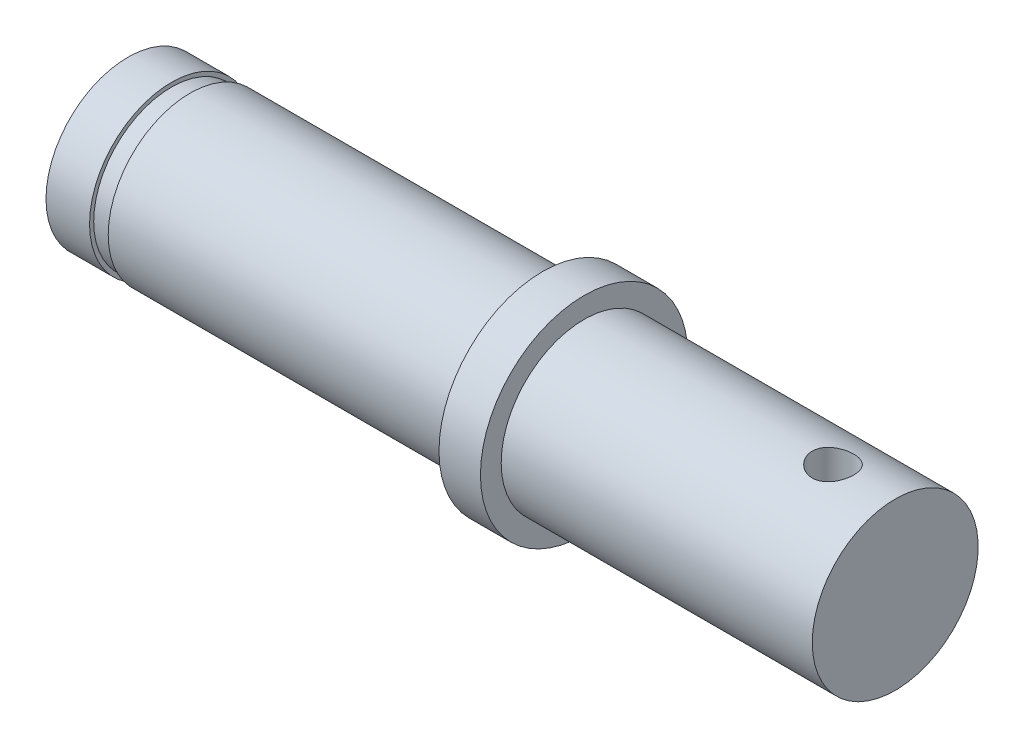
ISO-10303-21;
HEADER;
FILE_DESCRIPTION(('STEP AP214'),'2;1');
FILE_NAME('part.step','',(''),(''),'','','');
FILE_SCHEMA(('AUTOMOTIVE_DESIGN { 1 0 10303 214 1 1 1 1 }'));
ENDSEC;
DATA;
#1=APPLICATION_CONTEXT('core data for automotive mechanical design processes');
#2=APPLICATION_PROTOCOL_DEFINITION('international standard','automotive_design',2000,#1);
#3=PRODUCT_CONTEXT('',#1,'mechanical');
#4=PRODUCT('Part','Part','',(#3));
#5=PRODUCT_RELATED_PRODUCT_CATEGORY('part','',(#4));
#6=PRODUCT_DEFINITION_FORMATION('','',#4);
#7=PRODUCT_DEFINITION_CONTEXT('part definition',#1,'design');
#8=PRODUCT_DEFINITION('design','',#6,#7);
#9=PRODUCT_DEFINITION_SHAPE('','',#8);
#10=(LENGTH_UNIT() NAMED_UNIT(*) SI_UNIT(.MILLI.,.METRE.));
#11=(NAMED_UNIT(*) PLANE_ANGLE_UNIT() SI_UNIT($,.RADIAN.));
#12=(NAMED_UNIT(*) SI_UNIT($,.STERADIAN.) SOLID_ANGLE_UNIT());
#13=UNCERTAINTY_MEASURE_WITH_UNIT(LENGTH_MEASURE(1.E-05),#10,'distance_accuracy_value','');
#14=(GEOMETRIC_REPRESENTATION_CONTEXT(3) GLOBAL_UNCERTAINTY_ASSIGNED_CONTEXT((#13)) GLOBAL_UNIT_ASSIGNED_CONTEXT((#10,
#11,#12)) REPRESENTATION_CONTEXT('',''));
#15=CARTESIAN_POINT('',(0.,0.,0.));
#16=DIRECTION('',(0.,0.,1.));
#17=DIRECTION('',(1.,0.,0.));
#18=AXIS2_PLACEMENT_3D('',#15,#16,#17);
#19=CARTESIAN_POINT('',(-15.4994299751339,3.95,0.));
#20=DIRECTION('',(1.,0.,0.));
#21=DIRECTION('',(0.,0.,-1.));
#22=AXIS2_PLACEMENT_3D('',#19,#20,#21);
#23=PLANE('',#22);
#24=CARTESIAN_POINT('',(-15.4994299751339,0.,0.));
#25=DIRECTION('',(-1.,0.,0.));
#26=DIRECTION('',(0.,0.,1.));
#27=AXIS2_PLACEMENT_3D('',#24,#25,#26);
#28=CIRCLE('',#27,3.95);
#29=CARTESIAN_POINT('',(-15.4994299751339,0.,3.95));
#30=VERTEX_POINT('',#29);
#31=EDGE_CURVE('E122',#30,#30,#28,.T.);
#32=ORIENTED_EDGE('',*,*,#31,.T.);
#33=EDGE_LOOP('',(#32));
#34=FACE_BOUND('',#33,.T.);
#35=ADVANCED_FACE('F45',(#34),#23,.F.);
#36=CARTESIAN_POINT('',(21.5005700248661,0.,0.));
#37=DIRECTION('',(-1.,0.,0.));
#38=DIRECTION('',(0.,0.,1.));
#39=AXIS2_PLACEMENT_3D('',#36,#37,#38);
#40=PLANE('',#39);
#41=CARTESIAN_POINT('',(21.5005700248661,0.,0.));
#42=DIRECTION('',(-1.,0.,0.));
#43=DIRECTION('',(0.,0.,1.));
#44=AXIS2_PLACEMENT_3D('',#41,#42,#43);
#45=CIRCLE('',#44,4.);
#46=CARTESIAN_POINT('',(21.5005700248661,0.,4.));
#47=VERTEX_POINT('',#46);
#48=EDGE_CURVE('E12',#47,#47,#45,.T.);
#49=ORIENTED_EDGE('',*,*,#48,.F.);
#50=EDGE_LOOP('',(#49));
#51=FACE_BOUND('',#50,.T.);
#52=ADVANCED_FACE('F110',(#51),#40,.F.);
#53=CARTESIAN_POINT('',(-15.4994299751339,0.,0.));
#54=DIRECTION('',(-1.,0.,0.));
#55=DIRECTION('',(0.,0.,1.));
#56=AXIS2_PLACEMENT_3D('',#53,#54,#55);
#57=CYLINDRICAL_SURFACE('',#56,4.);
#58=CARTESIAN_POINT('',(18.5005700248661,-3.87298334620742,1.));
#59=CARTESIAN_POINT('',(18.5557903252229,-3.87298440057185,0.9999984314387));
#60=CARTESIAN_POINT('',(18.6110279842975,-3.87417722499279,0.995410498208071));
#61=CARTESIAN_POINT('',(18.7199170560987,-3.87880744892249,0.977209250194448));
#62=CARTESIAN_POINT('',(18.7735675266461,-3.88224615474181,0.963590682698079));
#63=CARTESIAN_POINT('',(18.8776914401539,-3.89095489813012,0.927796479849636));
#64=CARTESIAN_POINT('',(18.9281688870239,-3.8962225706936,0.905631891140945));
#65=CARTESIAN_POINT('',(19.0246943658786,-3.90799276818328,0.853408456505409));
#66=CARTESIAN_POINT('',(19.0707422096973,-3.91449534553241,0.823349275424507));
#67=CARTESIAN_POINT('',(19.158114682972,-3.92816286540369,0.755483370924519));
#68=CARTESIAN_POINT('',(19.1993274650064,-3.93533839048709,0.717534755081559));
#69=CARTESIAN_POINT('',(19.27487458261,-3.94945150206622,0.635272825640329));
#70=CARTESIAN_POINT('',(19.3092082751147,-3.95638906626692,0.590958917672141));
#71=CARTESIAN_POINT('',(19.3704802119187,-3.96936166208095,0.496458080431566));
#72=CARTESIAN_POINT('',(19.3973085801307,-3.975382749602,0.446197830478045));
#73=CARTESIAN_POINT('',(19.4420938825273,-3.98572324770431,0.34170527371711));
#74=CARTESIAN_POINT('',(19.4600521256323,-3.99004290933748,0.287473554316778));
#75=CARTESIAN_POINT('',(19.4862291586975,-3.99641903539263,0.177743503501663));
#76=CARTESIAN_POINT('',(19.4946378825967,-3.99851957537724,0.12229308781959));
#77=CARTESIAN_POINT('',(19.5020733765763,-4.00037437642922,0.0107315277051081));
#78=CARTESIAN_POINT('',(19.5011015337499,-4.00012898438683,-0.0453795178152274));
#79=CARTESIAN_POINT('',(19.4899400847661,-3.99735237981414,-0.155352247172388));
#80=CARTESIAN_POINT('',(19.4799554948446,-3.9948720093635,-0.209236215601067));
#81=CARTESIAN_POINT('',(19.4513815168467,-3.98796334609942,-0.314538247413687));
#82=CARTESIAN_POINT('',(19.4327916707151,-3.98353494959377,-0.365956179370439));
#83=CARTESIAN_POINT('',(19.3873689965913,-3.97315003880359,-0.465406703501807));
#84=CARTESIAN_POINT('',(19.3604632070014,-3.96718007878022,-0.513404509766505));
#85=CARTESIAN_POINT('',(19.2992277532196,-3.9543596152386,-0.604275622340489));
#86=CARTESIAN_POINT('',(19.2648967974419,-3.94750895860996,-0.647148035085506));
#87=CARTESIAN_POINT('',(19.1886865280732,-3.93345485507809,-0.727774035084958));
#88=CARTESIAN_POINT('',(19.146628067927,-3.92624687810367,-0.765357679075201));
#89=CARTESIAN_POINT('',(19.05673003545,-3.91246017406683,-0.83297637596302));
#90=CARTESIAN_POINT('',(19.0088901930697,-3.90588147642389,-0.863011076046018));
#91=CARTESIAN_POINT('',(18.9084540112065,-3.8940819873266,-0.914788129022599));
#92=CARTESIAN_POINT('',(18.8558357327408,-3.88886793490289,-0.936489566970492));
#93=CARTESIAN_POINT('',(18.7475358376355,-3.88047456055983,-0.970685620636342));
#94=CARTESIAN_POINT('',(18.6918548792729,-3.87729480324088,-0.983182206552911));
#95=CARTESIAN_POINT('',(18.5805862242569,-3.87342142415657,-0.998331855466072));
#96=CARTESIAN_POINT('',(18.5250349075343,-3.8726643563746,-1.00123618956785));
#97=CARTESIAN_POINT('',(18.4142412502348,-3.87354937392416,-0.99780679620622));
#98=CARTESIAN_POINT('',(18.3589988816856,-3.87519123840507,-0.991473919139521));
#99=CARTESIAN_POINT('',(18.2513243188842,-3.88062832781825,-0.969970185575066));
#100=CARTESIAN_POINT('',(18.1988609342378,-3.8843878809375,-0.954945627312699));
#101=CARTESIAN_POINT('',(18.0971974417254,-3.89360287308385,-0.916647232668249));
#102=CARTESIAN_POINT('',(18.047997721244,-3.89905851299446,-0.89337241908502));
#103=CARTESIAN_POINT('',(17.9531935137192,-3.91118454837305,-0.838708267174625));
#104=CARTESIAN_POINT('',(17.9076784888489,-3.91787667442657,-0.807168701534253));
#105=CARTESIAN_POINT('',(17.8224946797456,-3.93166833228687,-0.737060292934457));
#106=CARTESIAN_POINT('',(17.7828268582061,-3.93876793091388,-0.698490294805441));
#107=CARTESIAN_POINT('',(17.7094456078377,-3.95278961212643,-0.614262720984727));
#108=CARTESIAN_POINT('',(17.6759059998466,-3.95970280824735,-0.568451952531595));
#109=CARTESIAN_POINT('',(17.6169956780856,-3.97238886645494,-0.471702682694678));
#110=CARTESIAN_POINT('',(17.5916245382228,-3.97816178801584,-0.420764448957593));
#111=CARTESIAN_POINT('',(17.5499916110549,-3.98788046295326,-0.315558201731091));
#112=CARTESIAN_POINT('',(17.5336643111145,-3.99183932008964,-0.261317381027882));
#113=CARTESIAN_POINT('',(17.5103858910227,-3.99754117358316,-0.150749760318808));
#114=CARTESIAN_POINT('',(17.5034329613705,-3.99928459757364,-0.094423365041244));
#115=CARTESIAN_POINT('',(17.4992024352906,-4.00034169408812,0.0170835264433262));
#116=CARTESIAN_POINT('',(17.5016683157707,-3.99971978880009,0.0722538269660331));
#117=CARTESIAN_POINT('',(17.5156178521604,-3.99625896457424,0.18136749641474));
#118=CARTESIAN_POINT('',(17.5271012398792,-3.99342011157095,0.235310901780887));
#119=CARTESIAN_POINT('',(17.558622244637,-3.98585432853964,0.340171035644816));
#120=CARTESIAN_POINT('',(17.5786134781807,-3.98113764502669,0.391102494581018));
#121=CARTESIAN_POINT('',(17.6265406038854,-3.97031288913382,0.488917053041467));
#122=CARTESIAN_POINT('',(17.6544774975357,-3.96420464137727,0.535799641265051));
#123=CARTESIAN_POINT('',(17.7182852588632,-3.95107249681343,0.625401928423901));
#124=CARTESIAN_POINT('',(17.7543301677735,-3.94403016945647,0.667994988300587));
#125=CARTESIAN_POINT('',(17.8329928768399,-3.92990649053207,0.746615020271252));
#126=CARTESIAN_POINT('',(17.8756123409641,-3.92282512952424,0.782640325068178));
#127=CARTESIAN_POINT('',(17.9671714390674,-3.90927475860683,0.847762026479241));
#128=CARTESIAN_POINT('',(18.0162141482786,-3.90281963730391,0.876716619446595));
#129=CARTESIAN_POINT('',(18.118625514789,-3.8914395555011,0.925926896615624));
#130=CARTESIAN_POINT('',(18.1719909909734,-3.88651348244815,0.946188909759558));
#131=CARTESIAN_POINT('',(18.2711470366924,-3.87951908741315,0.974422528565573));
#132=CARTESIAN_POINT('',(18.3164631892485,-3.87708663005762,0.98399317059583));
#133=CARTESIAN_POINT('',(18.4080388938676,-3.87381838580358,0.996782292572821));
#134=CARTESIAN_POINT('',(18.4542983651167,-3.87298246270639,1.00000131437052));
#135=CARTESIAN_POINT('',(18.5005700248661,-3.87298334620742,1.));
#136=B_SPLINE_CURVE_WITH_KNOTS('',3,(#58,#59,#60,#61,#62,#63,#64,#65,#66,#67,#68,#69,#70,#71,
#72,#73,#74,#75,#76,#77,#78,#79,#80,#81,#82,#83,#84,#85,#86,#87,#88,#89,#90,#91,#92,#93,#94,#95,
#96,#97,#98,#99,#100,#101,#102,#103,#104,#105,#106,#107,#108,#109,#110,#111,#112,#113,#114,#115,
#116,#117,#118,#119,#120,#121,#122,#123,#124,#125,#126,#127,#128,#129,#130,#131,#132,#133,#134,
#135),.UNSPECIFIED.,.T.,.F.,(4,2,2,2,2,2,2,2,2,2,2,2,2,2,2,2,2,2,2,2,2,2,2,2,2,2,2,2,2,2,2,2,2,
2,2,2,2,2,4),(0.,0.16549097667523,0.331078296534212,0.496452290829149,0.66183330698466,
0.83049581673465,0.999174085882213,1.17020598555443,1.34121263935112,1.50875500394413,
1.67627259462683,1.84007305071854,2.00388222686189,2.16917149698053,2.3344895418384,
2.5042818662504,2.67408212476196,2.84470572799636,3.01529280048094,3.18137429900962,
3.34744050869796,3.51078961999958,3.67415808564842,3.84073138339938,4.00733207550293,
4.17810132382402,4.34886166284096,4.51836829119047,4.6878421955989,4.85273378447258,
5.01762046947068,5.18161950620159,5.34563922291504,5.51358838629103,5.68158012622479,
5.85270590910146,6.02370688542923,6.16239130867207,6.30106390036084),.UNSPECIFIED.);
#137=CARTESIAN_POINT('',(18.5005700248661,-3.87298334620742,1.));
#138=VERTEX_POINT('',#137);
#139=EDGE_CURVE('E48',#138,#138,#136,.T.);
#140=ORIENTED_EDGE('',*,*,#139,.T.);
#141=EDGE_LOOP('',(#140));
#142=FACE_BOUND('',#141,.T.);
#143=CARTESIAN_POINT('',(18.5005700248661,3.87298334620742,1.));
#144=CARTESIAN_POINT('',(18.4453497245093,3.87298440057185,0.9999984314387));
#145=CARTESIAN_POINT('',(18.3901120654348,3.87417722499279,0.995410498208071));
#146=CARTESIAN_POINT('',(18.2812229936335,3.87880744892249,0.977209250194448));
#147=CARTESIAN_POINT('',(18.2275725230861,3.88224615474181,0.963590682698079));
#148=CARTESIAN_POINT('',(18.1234486095783,3.89095489813012,0.927796479849635));
#149=CARTESIAN_POINT('',(18.0729711627083,3.8962225706936,0.905631891140943));
#150=CARTESIAN_POINT('',(17.9764456838536,3.90799276818328,0.853408456505406));
#151=CARTESIAN_POINT('',(17.930397840035,3.91449534553241,0.823349275424506));
#152=CARTESIAN_POINT('',(17.8430253667603,3.92816286540369,0.755483370924519));
#153=CARTESIAN_POINT('',(17.8018125847258,3.93533839048709,0.717534755081559));
#154=CARTESIAN_POINT('',(17.7262654671222,3.94945150206622,0.635272825640329));
#155=CARTESIAN_POINT('',(17.6919317746175,3.95638906626692,0.590958917672141));
#156=CARTESIAN_POINT('',(17.6306598378135,3.96936166208095,0.496458080431566));
#157=CARTESIAN_POINT('',(17.6038314696015,3.975382749602,0.446197830478045));
#158=CARTESIAN_POINT('',(17.5590461672049,3.98572324770431,0.34170527371711));
#159=CARTESIAN_POINT('',(17.5410879240999,3.99004290933748,0.287473554316778));
#160=CARTESIAN_POINT('',(17.5149108910347,3.99641903539263,0.177743503501663));
#161=CARTESIAN_POINT('',(17.5065021671355,3.99851957537724,0.12229308781959));
#162=CARTESIAN_POINT('',(17.4990666731559,4.00037437642922,0.0107315277051081));
#163=CARTESIAN_POINT('',(17.5000385159823,4.00012898438683,-0.0453795178152275));
#164=CARTESIAN_POINT('',(17.5111999649662,3.99735237981414,-0.155352247172388));
#165=CARTESIAN_POINT('',(17.5211845548877,3.9948720093635,-0.209236215601067));
#166=CARTESIAN_POINT('',(17.5497585328855,3.98796334609942,-0.314538247413687));
#167=CARTESIAN_POINT('',(17.5683483790171,3.98353494959377,-0.365956179370439));
#168=CARTESIAN_POINT('',(17.6137710531409,3.97315003880359,-0.465406703501808));
#169=CARTESIAN_POINT('',(17.6406768427308,3.96718007878022,-0.513404509766506));
#170=CARTESIAN_POINT('',(17.7019122965126,3.9543596152386,-0.60427562234049));
#171=CARTESIAN_POINT('',(17.7362432522904,3.94750895860996,-0.647148035085507));
#172=CARTESIAN_POINT('',(17.8124535216591,3.93345485507809,-0.727774035084958));
#173=CARTESIAN_POINT('',(17.8545119818052,3.92624687810367,-0.765357679075201));
#174=CARTESIAN_POINT('',(17.9444100142822,3.91246017406683,-0.83297637596302));
#175=CARTESIAN_POINT('',(17.9922498566625,3.90588147642389,-0.863011076046018));
#176=CARTESIAN_POINT('',(18.0926860385257,3.8940819873266,-0.914788129022599));
#177=CARTESIAN_POINT('',(18.1453043169914,3.88886793490289,-0.936489566970492));
#178=CARTESIAN_POINT('',(18.2536042120967,3.88047456055983,-0.970685620636342));
#179=CARTESIAN_POINT('',(18.3092851704594,3.87729480324088,-0.983182206552911));
#180=CARTESIAN_POINT('',(18.4205538254754,3.87342142415657,-0.998331855466072));
#181=CARTESIAN_POINT('',(18.476105142198,3.8726643563746,-1.00123618956785));
#182=CARTESIAN_POINT('',(18.5868987994974,3.87354937392416,-0.99780679620622));
#183=CARTESIAN_POINT('',(18.6421411680466,3.87519123840507,-0.991473919139521));
#184=CARTESIAN_POINT('',(18.749815730848,3.88062832781825,-0.969970185575066));
#185=CARTESIAN_POINT('',(18.8022791154944,3.8843878809375,-0.954945627312699));
#186=CARTESIAN_POINT('',(18.9039426080068,3.89360287308385,-0.916647232668249));
#187=CARTESIAN_POINT('',(18.9531423284882,3.89905851299446,-0.89337241908502));
#188=CARTESIAN_POINT('',(19.0479465360131,3.91118454837305,-0.838708267174625));
#189=CARTESIAN_POINT('',(19.0934615608833,3.91787667442657,-0.807168701534253));
#190=CARTESIAN_POINT('',(19.1786453699867,3.93166833228687,-0.737060292934457));
#191=CARTESIAN_POINT('',(19.2183131915261,3.93876793091388,-0.69849029480544));
#192=CARTESIAN_POINT('',(19.2916944418945,3.95278961212643,-0.614262720984726));
#193=CARTESIAN_POINT('',(19.3252340498856,3.95970280824735,-0.568451952531593));
#194=CARTESIAN_POINT('',(19.3841443716466,3.97238886645494,-0.471702682694676));
#195=CARTESIAN_POINT('',(19.4095155115094,3.97816178801584,-0.420764448957591));
#196=CARTESIAN_POINT('',(19.4511484386773,3.98788046295326,-0.315558201731091));
#197=CARTESIAN_POINT('',(19.4674757386177,3.99183932008964,-0.261317381027882));
#198=CARTESIAN_POINT('',(19.4907541587095,3.99754117358316,-0.150749760318809));
#199=CARTESIAN_POINT('',(19.4977070883617,3.99928459757364,-0.0944233650412441));
#200=CARTESIAN_POINT('',(19.5019376144416,4.00034169408812,0.0170835264433262));
#201=CARTESIAN_POINT('',(19.4994717339615,3.99971978880009,0.0722538269660331));
#202=CARTESIAN_POINT('',(19.4855221975718,3.99625896457424,0.18136749641474));
#203=CARTESIAN_POINT('',(19.474038809853,3.99342011157095,0.235310901780887));
#204=CARTESIAN_POINT('',(19.4425178050952,3.98585432853964,0.340171035644816));
#205=CARTESIAN_POINT('',(19.4225265715515,3.98113764502669,0.391102494581018));
#206=CARTESIAN_POINT('',(19.3745994458468,3.97031288913382,0.488917053041467));
#207=CARTESIAN_POINT('',(19.3466625521965,3.96420464137727,0.535799641265051));
#208=CARTESIAN_POINT('',(19.282854790869,3.95107249681343,0.625401928423901));
#209=CARTESIAN_POINT('',(19.2468098819587,3.94403016945647,0.667994988300587));
#210=CARTESIAN_POINT('',(19.1681471728923,3.92990649053207,0.746615020271252));
#211=CARTESIAN_POINT('',(19.1255277087682,3.92282512952424,0.782640325068178));
#212=CARTESIAN_POINT('',(19.0339686106648,3.90927475860683,0.847762026479241));
#213=CARTESIAN_POINT('',(18.9849259014536,3.90281963730391,0.876716619446595));
#214=CARTESIAN_POINT('',(18.8825145349433,3.8914395555011,0.925926896615624));
#215=CARTESIAN_POINT('',(18.8291490587588,3.88651348244815,0.946188909759558));
#216=CARTESIAN_POINT('',(18.7299930130398,3.87951908741315,0.974422528565573));
#217=CARTESIAN_POINT('',(18.6846768604838,3.87708663005762,0.98399317059583));
#218=CARTESIAN_POINT('',(18.5931011558646,3.87381838580358,0.996782292572821));
#219=CARTESIAN_POINT('',(18.5468416846155,3.87298246270639,1.00000131437052));
#220=CARTESIAN_POINT('',(18.5005700248661,3.87298334620742,1.));
#221=B_SPLINE_CURVE_WITH_KNOTS('',3,(#143,#144,#145,#146,#147,#148,#149,#150,#151,#152,#153,
#154,#155,#156,#157,#158,#159,#160,#161,#162,#163,#164,#165,#166,#167,#168,#169,#170,#171,#172,
#173,#174,#175,#176,#177,#178,#179,#180,#181,#182,#183,#184,#185,#186,#187,#188,#189,#190,#191,
#192,#193,#194,#195,#196,#197,#198,#199,#200,#201,#202,#203,#204,#205,#206,#207,#208,#209,#210,
#211,#212,#213,#214,#215,#216,#217,#218,#219,#220),.UNSPECIFIED.,.T.,.F.,(4,2,2,2,2,2,2,2,2,2,2,
2,2,2,2,2,2,2,2,2,2,2,2,2,2,2,2,2,2,2,2,2,2,2,2,2,2,2,4),(0.,0.16549097667523,0.331078296534212,
0.496452290829157,0.66183330698466,0.83049581673465,0.999174085882213,1.17020598555443,
1.34121263935112,1.50875500394413,1.67627259462683,1.84007305071854,2.00388222686189,
2.16917149698053,2.3344895418384,2.5042818662504,2.67408212476196,2.84470572799636,
3.01529280048094,3.18137429900962,3.34744050869796,3.51078961999958,3.67415808564842,
3.84073138339938,4.00733207550293,4.17810132382403,4.34886166284096,4.51836829119047,
4.6878421955989,4.85273378447258,5.01762046947068,5.18161950620159,5.34563922291504,
5.51358838629103,5.68158012622479,5.85270590910146,6.02370688542923,6.16239130867207,
6.30106390036084),.UNSPECIFIED.);
#222=CARTESIAN_POINT('',(18.5005700248661,3.87298334620742,1.));
#223=VERTEX_POINT('',#222);
#224=EDGE_CURVE('E64',#223,#223,#221,.T.);
#225=ORIENTED_EDGE('',*,*,#224,.T.);
#226=EDGE_LOOP('',(#225));
#227=FACE_BOUND('',#226,.T.);
#228=CARTESIAN_POINT('',(6.50057002486611,0.,0.));
#229=DIRECTION('',(-1.,0.,0.));
#230=DIRECTION('',(0.,0.,1.));
#231=AXIS2_PLACEMENT_3D('',#228,#229,#230);
#232=CIRCLE('',#231,4.);
#233=CARTESIAN_POINT('',(6.50057002486611,0.,4.));
#234=VERTEX_POINT('',#233);
#235=EDGE_CURVE('E56',#234,#234,#232,.T.);
#236=ORIENTED_EDGE('',*,*,#235,.F.);
#237=EDGE_LOOP('',(#236));
#238=FACE_BOUND('',#237,.T.);
#239=ORIENTED_EDGE('',*,*,#48,.T.);
#240=EDGE_LOOP('',(#239));
#241=FACE_BOUND('',#240,.T.);
#242=ADVANCED_FACE('F68',(#142,#227,#238,#241),#57,.T.);
#243=CARTESIAN_POINT('',(6.50057002486611,4.,0.));
#244=DIRECTION('',(-1.,0.,0.));
#245=DIRECTION('',(0.,0.,1.));
#246=AXIS2_PLACEMENT_3D('',#243,#244,#245);
#247=PLANE('',#246);
#248=CARTESIAN_POINT('',(6.50057002486611,0.,0.));
#249=DIRECTION('',(-1.,0.,0.));
#250=DIRECTION('',(0.,0.,1.));
#251=AXIS2_PLACEMENT_3D('',#248,#249,#250);
#252=CIRCLE('',#251,5.);
#253=CARTESIAN_POINT('',(6.50057002486611,0.,5.));
#254=VERTEX_POINT('',#253);
#255=EDGE_CURVE('E61',#254,#254,#252,.T.);
#256=ORIENTED_EDGE('',*,*,#255,.F.);
#257=EDGE_LOOP('',(#256));
#258=FACE_BOUND('',#257,.T.);
#259=ORIENTED_EDGE('',*,*,#235,.T.);
#260=EDGE_LOOP('',(#259));
#261=FACE_BOUND('',#260,.T.);
#262=ADVANCED_FACE('F103',(#258,#261),#247,.F.);
#263=CARTESIAN_POINT('',(-15.4994299751339,0.,0.));
#264=DIRECTION('',(-1.,0.,0.));
#265=DIRECTION('',(0.,0.,1.));
#266=AXIS2_PLACEMENT_3D('',#263,#264,#265);
#267=CYLINDRICAL_SURFACE('',#266,5.);
#268=CARTESIAN_POINT('',(4.50057002486611,0.,0.));
#269=DIRECTION('',(-1.,0.,0.));
#270=DIRECTION('',(0.,0.,1.));
#271=AXIS2_PLACEMENT_3D('',#268,#269,#270);
#272=CIRCLE('',#271,5.);
#273=CARTESIAN_POINT('',(4.50057002486611,0.,5.));
#274=VERTEX_POINT('',#273);
#275=EDGE_CURVE('E141',#274,#274,#272,.T.);
#276=ORIENTED_EDGE('',*,*,#275,.F.);
#277=EDGE_LOOP('',(#276));
#278=FACE_BOUND('',#277,.T.);
#279=ORIENTED_EDGE('',*,*,#255,.T.);
#280=EDGE_LOOP('',(#279));
#281=FACE_BOUND('',#280,.T.);
#282=ADVANCED_FACE('F100',(#278,#281),#267,.T.);
#283=CARTESIAN_POINT('',(4.50057002486611,5.,0.));
#284=DIRECTION('',(1.,0.,0.));
#285=DIRECTION('',(0.,0.,-1.));
#286=AXIS2_PLACEMENT_3D('',#283,#284,#285);
#287=PLANE('',#286);
#288=CARTESIAN_POINT('',(4.5005700248661,0.,0.));
#289=DIRECTION('',(-1.,0.,0.));
#290=DIRECTION('',(0.,0.,1.));
#291=AXIS2_PLACEMENT_3D('',#288,#289,#290);
#292=CIRCLE('',#291,3.95);
#293=CARTESIAN_POINT('',(4.5005700248661,0.,3.95));
#294=VERTEX_POINT('',#293);
#295=EDGE_CURVE('E138',#294,#294,#292,.T.);
#296=ORIENTED_EDGE('',*,*,#295,.F.);
#297=EDGE_LOOP('',(#296));
#298=FACE_BOUND('',#297,.T.);
#299=ORIENTED_EDGE('',*,*,#275,.T.);
#300=EDGE_LOOP('',(#299));
#301=FACE_BOUND('',#300,.T.);
#302=ADVANCED_FACE('F96',(#298,#301),#287,.F.);
#303=CARTESIAN_POINT('',(-15.4994299751339,0.,0.));
#304=DIRECTION('',(-1.,0.,0.));
#305=DIRECTION('',(0.,0.,1.));
#306=AXIS2_PLACEMENT_3D('',#303,#304,#305);
#307=CYLINDRICAL_SURFACE('',#306,3.95);
#308=CARTESIAN_POINT('',(-12.4994299751339,0.,0.));
#309=DIRECTION('',(-1.,0.,0.));
#310=DIRECTION('',(0.,0.,1.));
#311=AXIS2_PLACEMENT_3D('',#308,#309,#310);
#312=CIRCLE('',#311,3.95);
#313=CARTESIAN_POINT('',(-12.4994299751339,0.,3.95));
#314=VERTEX_POINT('',#313);
#315=EDGE_CURVE('E135',#314,#314,#312,.T.);
#316=ORIENTED_EDGE('',*,*,#315,.F.);
#317=EDGE_LOOP('',(#316));
#318=FACE_BOUND('',#317,.T.);
#319=ORIENTED_EDGE('',*,*,#295,.T.);
#320=EDGE_LOOP('',(#319));
#321=FACE_BOUND('',#320,.T.);
#322=ADVANCED_FACE('F92',(#318,#321),#307,.T.);
#323=CARTESIAN_POINT('',(-12.4994299751339,3.75,0.));
#324=DIRECTION('',(1.,0.,0.));
#325=DIRECTION('',(0.,0.,-1.));
#326=AXIS2_PLACEMENT_3D('',#323,#324,#325);
#327=PLANE('',#326);
#328=CARTESIAN_POINT('',(-12.4994299751339,0.,0.));
#329=DIRECTION('',(-1.,0.,0.));
#330=DIRECTION('',(0.,0.,1.));
#331=AXIS2_PLACEMENT_3D('',#328,#329,#330);
#332=CIRCLE('',#331,3.75);
#333=CARTESIAN_POINT('',(-12.4994299751339,0.,3.75));
#334=VERTEX_POINT('',#333);
#335=EDGE_CURVE('E132',#334,#334,#332,.T.);
#336=ORIENTED_EDGE('',*,*,#335,.F.);
#337=EDGE_LOOP('',(#336));
#338=FACE_BOUND('',#337,.T.);
#339=ORIENTED_EDGE('',*,*,#315,.T.);
#340=EDGE_LOOP('',(#339));
#341=FACE_BOUND('',#340,.T.);
#342=ADVANCED_FACE('F88',(#338,#341),#327,.F.);
#343=CARTESIAN_POINT('',(-15.4994299751339,0.,0.));
#344=DIRECTION('',(-1.,0.,0.));
#345=DIRECTION('',(0.,0.,1.));
#346=AXIS2_PLACEMENT_3D('',#343,#344,#345);
#347=CYLINDRICAL_SURFACE('',#346,3.75);
#348=CARTESIAN_POINT('',(-13.3994299751339,0.,0.));
#349=DIRECTION('',(-1.,0.,0.));
#350=DIRECTION('',(0.,0.,1.));
#351=AXIS2_PLACEMENT_3D('',#348,#349,#350);
#352=CIRCLE('',#351,3.75);
#353=CARTESIAN_POINT('',(-13.3994299751339,0.,3.75));
#354=VERTEX_POINT('',#353);
#355=EDGE_CURVE('E126',#354,#354,#352,.T.);
#356=ORIENTED_EDGE('',*,*,#355,.F.);
#357=EDGE_LOOP('',(#356));
#358=FACE_BOUND('',#357,.T.);
#359=ORIENTED_EDGE('',*,*,#335,.T.);
#360=EDGE_LOOP('',(#359));
#361=FACE_BOUND('',#360,.T.);
#362=ADVANCED_FACE('F84',(#358,#361),#347,.T.);
#363=CARTESIAN_POINT('',(-13.3994299751339,3.95,0.));
#364=DIRECTION('',(-1.,0.,0.));
#365=DIRECTION('',(0.,0.,1.));
#366=AXIS2_PLACEMENT_3D('',#363,#364,#365);
#367=PLANE('',#366);
#368=CARTESIAN_POINT('',(-13.3994299751339,0.,0.));
#369=DIRECTION('',(-1.,0.,0.));
#370=DIRECTION('',(0.,0.,1.));
#371=AXIS2_PLACEMENT_3D('',#368,#369,#370);
#372=CIRCLE('',#371,3.95);
#373=CARTESIAN_POINT('',(-13.3994299751339,0.,3.95));
#374=VERTEX_POINT('',#373);
#375=EDGE_CURVE('E123',#374,#374,#372,.T.);
#376=ORIENTED_EDGE('',*,*,#375,.F.);
#377=EDGE_LOOP('',(#376));
#378=FACE_BOUND('',#377,.T.);
#379=ORIENTED_EDGE('',*,*,#355,.T.);
#380=EDGE_LOOP('',(#379));
#381=FACE_BOUND('',#380,.T.);
#382=ADVANCED_FACE('F80',(#378,#381),#367,.F.);
#383=CARTESIAN_POINT('',(-15.4994299751339,0.,0.));
#384=DIRECTION('',(-1.,0.,0.));
#385=DIRECTION('',(0.,0.,1.));
#386=AXIS2_PLACEMENT_3D('',#383,#384,#385);
#387=CYLINDRICAL_SURFACE('',#386,3.95);
#388=ORIENTED_EDGE('',*,*,#31,.F.);
#389=EDGE_LOOP('',(#388));
#390=FACE_BOUND('',#389,.T.);
#391=ORIENTED_EDGE('',*,*,#375,.T.);
#392=EDGE_LOOP('',(#391));
#393=FACE_BOUND('',#392,.T.);
#394=ADVANCED_FACE('F75',(#390,#393),#387,.T.);
#395=CARTESIAN_POINT('',(18.5005700248661,-5.,0.));
#396=DIRECTION('',(0.,1.,0.));
#397=DIRECTION('',(0.,0.,1.));
#398=AXIS2_PLACEMENT_3D('',#395,#396,#397);
#399=CYLINDRICAL_SURFACE('',#398,1.);
#400=ORIENTED_EDGE('',*,*,#224,.F.);
#401=EDGE_LOOP('',(#400));
#402=FACE_BOUND('',#401,.T.);
#403=ORIENTED_EDGE('',*,*,#139,.F.);
#404=EDGE_LOOP('',(#403));
#405=FACE_BOUND('',#404,.T.);
#406=ADVANCED_FACE('F71',(#402,#405),#399,.F.);
#407=CLOSED_SHELL('',(#35,#52,#242,#262,#282,#302,#322,#342,#362,#382,#394,#406));
#408=MANIFOLD_SOLID_BREP('B2',#407);
#409=ADVANCED_BREP_SHAPE_REPRESENTATION('',(#18,#408),#14);
#410=SHAPE_DEFINITION_REPRESENTATION(#9,#409);
ENDSEC;
END-ISO-10303-21;
